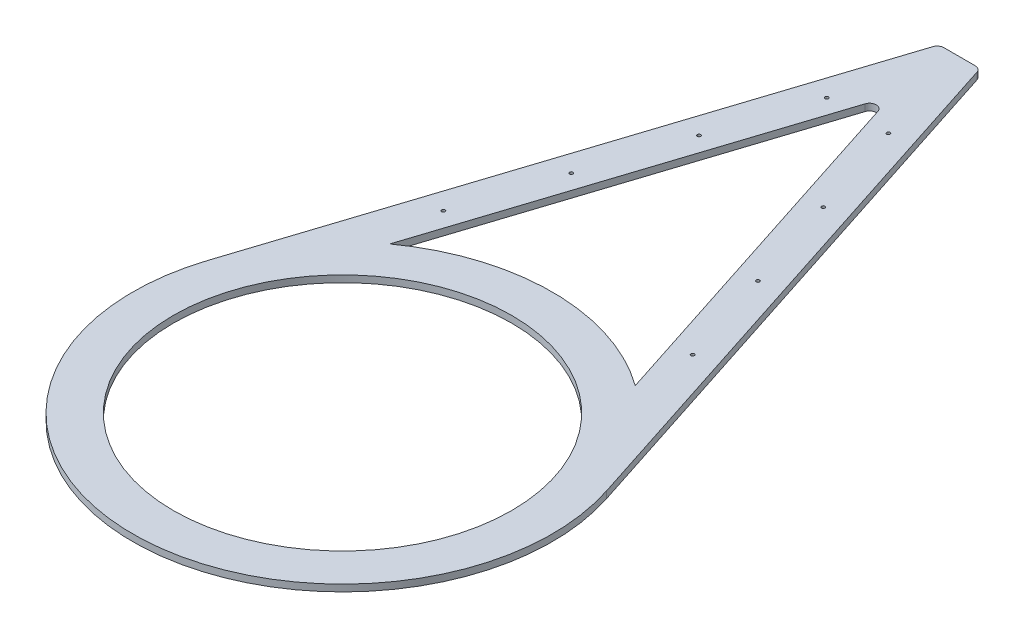
ISO-10303-21;
HEADER;
FILE_DESCRIPTION(('STEP AP214'),'2;1');
FILE_NAME('part.step','',(''),(''),'','','');
FILE_SCHEMA(('AUTOMOTIVE_DESIGN { 1 0 10303 214 1 1 1 1 }'));
ENDSEC;
DATA;
#1=APPLICATION_CONTEXT('core data for automotive mechanical design processes');
#2=APPLICATION_PROTOCOL_DEFINITION('international standard','automotive_design',2000,#1);
#3=PRODUCT_CONTEXT('',#1,'mechanical');
#4=PRODUCT('Part','Part','',(#3));
#5=PRODUCT_RELATED_PRODUCT_CATEGORY('part','',(#4));
#6=PRODUCT_DEFINITION_FORMATION('','',#4);
#7=PRODUCT_DEFINITION_CONTEXT('part definition',#1,'design');
#8=PRODUCT_DEFINITION('design','',#6,#7);
#9=PRODUCT_DEFINITION_SHAPE('','',#8);
#10=(LENGTH_UNIT() NAMED_UNIT(*) SI_UNIT(.MILLI.,.METRE.));
#11=(NAMED_UNIT(*) PLANE_ANGLE_UNIT() SI_UNIT($,.RADIAN.));
#12=(NAMED_UNIT(*) SI_UNIT($,.STERADIAN.) SOLID_ANGLE_UNIT());
#13=UNCERTAINTY_MEASURE_WITH_UNIT(LENGTH_MEASURE(1.E-05),#10,'distance_accuracy_value','');
#14=(GEOMETRIC_REPRESENTATION_CONTEXT(3) GLOBAL_UNCERTAINTY_ASSIGNED_CONTEXT((#13)) GLOBAL_UNIT_ASSIGNED_CONTEXT((#10,
#11,#12)) REPRESENTATION_CONTEXT('',''));
#15=CARTESIAN_POINT('',(0.,0.,0.));
#16=DIRECTION('',(0.,0.,1.));
#17=DIRECTION('',(1.,0.,0.));
#18=AXIS2_PLACEMENT_3D('',#15,#16,#17);
#19=CARTESIAN_POINT('',(-250.781032551846,10.,-37.0633584025956));
#20=DIRECTION('',(-0.951348450923488,0.,-0.308117063671392));
#21=DIRECTION('',(-0.308117063671392,0.,0.951348450923488));
#22=AXIS2_PLACEMENT_3D('',#19,#20,#21);
#23=PLANE('',#22);
#24=DIRECTION('',(0.308117063671392,0.,-0.951348450923488));
#25=VECTOR('',#24,1.);
#26=CARTESIAN_POINT('',(-250.781032551846,0.,-37.0633584025956));
#27=LINE('',#26,#25);
#28=CARTESIAN_POINT('',(-181.388362207426,0.,-251.321564848491));
#29=VERTEX_POINT('',#28);
#30=CARTESIAN_POINT('',(-9.51348450923489,0.,-782.005898596476));
#31=VERTEX_POINT('',#30);
#32=EDGE_CURVE('E187',#29,#31,#27,.T.);
#33=ORIENTED_EDGE('',*,*,#32,.T.);
#34=DIRECTION('',(0.,-1.,0.));
#35=VECTOR('',#34,1.);
#36=CARTESIAN_POINT('',(-9.51348450923489,10.,-782.005898596476));
#37=LINE('',#36,#35);
#38=CARTESIAN_POINT('',(-9.51348450923489,10.,-782.005898596476));
#39=VERTEX_POINT('',#38);
#40=EDGE_CURVE('E11',#39,#31,#37,.T.);
#41=ORIENTED_EDGE('',*,*,#40,.F.);
#42=DIRECTION('',(0.308117063671392,0.,-0.951348450923488));
#43=VECTOR('',#42,1.);
#44=CARTESIAN_POINT('',(-250.781032551846,10.,-37.0633584025956));
#45=LINE('',#44,#43);
#46=CARTESIAN_POINT('',(-181.388362207426,10.,-251.321564848491));
#47=VERTEX_POINT('',#46);
#48=EDGE_CURVE('E125',#47,#39,#45,.T.);
#49=ORIENTED_EDGE('',*,*,#48,.F.);
#50=DIRECTION('',(0.,-1.,0.));
#51=VECTOR('',#50,1.);
#52=CARTESIAN_POINT('',(-181.388362207426,10.,-251.321564848491));
#53=LINE('',#52,#51);
#54=EDGE_CURVE('E201',#47,#29,#53,.T.);
#55=ORIENTED_EDGE('',*,*,#54,.T.);
#56=EDGE_LOOP('',(#33,#41,#49,#55));
#57=FACE_BOUND('',#56,.T.);
#58=ADVANCED_FACE('F35',(#57),#23,.F.);
#59=CARTESIAN_POINT('',(0.,10.,-778.924727959763));
#60=DIRECTION('',(0.,-1.,0.));
#61=DIRECTION('',(0.,0.,-1.));
#62=AXIS2_PLACEMENT_3D('',#59,#60,#61);
#63=CYLINDRICAL_SURFACE('',#62,9.99999999999999);
#64=CARTESIAN_POINT('',(0.,0.,-778.924727959763));
#65=DIRECTION('',(0.,1.,0.));
#66=DIRECTION('',(0.,0.,1.));
#67=AXIS2_PLACEMENT_3D('',#64,#65,#66);
#68=CIRCLE('',#67,9.99999999999999);
#69=CARTESIAN_POINT('',(9.51348450923495,0.,-782.005898596477));
#70=VERTEX_POINT('',#69);
#71=EDGE_CURVE('E131',#31,#70,#68,.F.);
#72=ORIENTED_EDGE('',*,*,#71,.T.);
#73=DIRECTION('',(0.,-1.,0.));
#74=VECTOR('',#73,1.);
#75=CARTESIAN_POINT('',(9.51348450923495,10.,-782.005898596477));
#76=LINE('',#75,#74);
#77=CARTESIAN_POINT('',(9.51348450923495,10.,-782.005898596477));
#78=VERTEX_POINT('',#77);
#79=EDGE_CURVE('E45',#78,#70,#76,.T.);
#80=ORIENTED_EDGE('',*,*,#79,.F.);
#81=CARTESIAN_POINT('',(0.,10.,-778.924727959763));
#82=DIRECTION('',(0.,1.,0.));
#83=DIRECTION('',(0.,0.,1.));
#84=AXIS2_PLACEMENT_3D('',#81,#82,#83);
#85=CIRCLE('',#84,9.99999999999999);
#86=EDGE_CURVE('E118',#39,#78,#85,.F.);
#87=ORIENTED_EDGE('',*,*,#86,.F.);
#88=ORIENTED_EDGE('',*,*,#40,.T.);
#89=EDGE_LOOP('',(#72,#80,#87,#88));
#90=FACE_BOUND('',#89,.T.);
#91=ADVANCED_FACE('F130',(#90),#63,.F.);
#92=CARTESIAN_POINT('',(48.3839562648249,10.,-661.988647196262));
#93=DIRECTION('',(-0.951348450923487,0.,0.308117063671394));
#94=DIRECTION('',(0.308117063671394,0.,0.951348450923487));
#95=AXIS2_PLACEMENT_3D('',#92,#93,#94);
#96=PLANE('',#95);
#97=DIRECTION('',(-0.308117063671394,0.,-0.951348450923487));
#98=VECTOR('',#97,1.);
#99=CARTESIAN_POINT('',(48.3839562648249,0.,-661.988647196262));
#100=LINE('',#99,#98);
#101=CARTESIAN_POINT('',(181.388362207428,0.,-251.32156484849));
#102=VERTEX_POINT('',#101);
#103=EDGE_CURVE('E191',#102,#70,#100,.T.);
#104=ORIENTED_EDGE('',*,*,#103,.F.);
#105=DIRECTION('',(0.,-1.,0.));
#106=VECTOR('',#105,1.);
#107=CARTESIAN_POINT('',(181.388362207428,10.,-251.32156484849));
#108=LINE('',#107,#106);
#109=CARTESIAN_POINT('',(181.388362207428,10.,-251.32156484849));
#110=VERTEX_POINT('',#109);
#111=EDGE_CURVE('E88',#110,#102,#108,.T.);
#112=ORIENTED_EDGE('',*,*,#111,.F.);
#113=DIRECTION('',(-0.308117063671394,0.,-0.951348450923487));
#114=VECTOR('',#113,1.);
#115=CARTESIAN_POINT('',(48.3839562648249,10.,-661.988647196262));
#116=LINE('',#115,#114);
#117=EDGE_CURVE('E123',#110,#78,#116,.T.);
#118=ORIENTED_EDGE('',*,*,#117,.T.);
#119=ORIENTED_EDGE('',*,*,#79,.T.);
#120=EDGE_LOOP('',(#104,#112,#118,#119));
#121=FACE_BOUND('',#120,.T.);
#122=ADVANCED_FACE('F136',(#121),#96,.T.);
#123=CARTESIAN_POINT('',(23.1136744500693,10.,-902.102593467323));
#124=DIRECTION('',(0.,-1.,0.));
#125=DIRECTION('',(0.,0.,-1.));
#126=AXIS2_PLACEMENT_3D('',#123,#124,#125);
#127=CYLINDRICAL_SURFACE('',#126,10.);
#128=CARTESIAN_POINT('',(23.1136744500693,0.,-902.102593467323));
#129=DIRECTION('',(0.,1.,0.));
#130=DIRECTION('',(0.,0.,1.));
#131=AXIS2_PLACEMENT_3D('',#128,#129,#130);
#132=CIRCLE('',#131,10.);
#133=CARTESIAN_POINT('',(23.1136744500693,0.,-912.102593467323));
#134=VERTEX_POINT('',#133);
#135=CARTESIAN_POINT('',(32.6271589593041,0.,-905.183764104037));
#136=VERTEX_POINT('',#135);
#137=EDGE_CURVE('E166',#134,#136,#132,.F.);
#138=ORIENTED_EDGE('',*,*,#137,.F.);
#139=DIRECTION('',(0.,-1.,0.));
#140=VECTOR('',#139,1.);
#141=CARTESIAN_POINT('',(23.1136744500693,10.,-912.102593467323));
#142=LINE('',#141,#140);
#143=CARTESIAN_POINT('',(23.1136744500693,10.,-912.102593467323));
#144=VERTEX_POINT('',#143);
#145=EDGE_CURVE('E39',#144,#134,#142,.T.);
#146=ORIENTED_EDGE('',*,*,#145,.F.);
#147=CARTESIAN_POINT('',(23.1136744500693,10.,-902.102593467323));
#148=DIRECTION('',(0.,1.,0.));
#149=DIRECTION('',(0.,0.,1.));
#150=AXIS2_PLACEMENT_3D('',#147,#148,#149);
#151=CIRCLE('',#150,10.);
#152=CARTESIAN_POINT('',(32.6271589593041,10.,-905.183764104037));
#153=VERTEX_POINT('',#152);
#154=EDGE_CURVE('E352',#144,#153,#151,.F.);
#155=ORIENTED_EDGE('',*,*,#154,.T.);
#156=DIRECTION('',(0.,-1.,0.));
#157=VECTOR('',#156,1.);
#158=CARTESIAN_POINT('',(32.6271589593041,10.,-905.183764104037));
#159=LINE('',#158,#157);
#160=EDGE_CURVE('E147',#153,#136,#159,.T.);
#161=ORIENTED_EDGE('',*,*,#160,.T.);
#162=EDGE_LOOP('',(#138,#146,#155,#161));
#163=FACE_BOUND('',#162,.T.);
#164=ADVANCED_FACE('F221',(#163),#127,.T.);
#165=CARTESIAN_POINT('',(-1065.96449162998,10.,-912.102593467323));
#166=DIRECTION('',(0.,0.,-1.));
#167=DIRECTION('',(-1.,0.,0.));
#168=AXIS2_PLACEMENT_3D('',#165,#166,#167);
#169=PLANE('',#168);
#170=DIRECTION('',(1.,0.,0.));
#171=VECTOR('',#170,1.);
#172=CARTESIAN_POINT('',(-1065.96449162998,0.,-912.102593467323));
#173=LINE('',#172,#171);
#174=CARTESIAN_POINT('',(-23.1136744500693,0.,-912.102593467323));
#175=VERTEX_POINT('',#174);
#176=EDGE_CURVE('E169',#175,#134,#173,.T.);
#177=ORIENTED_EDGE('',*,*,#176,.F.);
#178=DIRECTION('',(0.,-1.,0.));
#179=VECTOR('',#178,1.);
#180=CARTESIAN_POINT('',(-23.1136744500693,10.,-912.102593467323));
#181=LINE('',#180,#179);
#182=CARTESIAN_POINT('',(-23.1136744500693,10.,-912.102593467323));
#183=VERTEX_POINT('',#182);
#184=EDGE_CURVE('E211',#183,#175,#181,.T.);
#185=ORIENTED_EDGE('',*,*,#184,.F.);
#186=DIRECTION('',(1.,0.,0.));
#187=VECTOR('',#186,1.);
#188=CARTESIAN_POINT('',(-1065.96449162998,10.,-912.102593467323));
#189=LINE('',#188,#187);
#190=EDGE_CURVE('E220',#183,#144,#189,.T.);
#191=ORIENTED_EDGE('',*,*,#190,.T.);
#192=ORIENTED_EDGE('',*,*,#145,.T.);
#193=EDGE_LOOP('',(#177,#185,#191,#192));
#194=FACE_BOUND('',#193,.T.);
#195=ADVANCED_FACE('F218',(#194),#169,.T.);
#196=CARTESIAN_POINT('',(-23.1136744500693,10.,-902.102593467323));
#197=DIRECTION('',(0.,-1.,0.));
#198=DIRECTION('',(0.,0.,-1.));
#199=AXIS2_PLACEMENT_3D('',#196,#197,#198);
#200=CYLINDRICAL_SURFACE('',#199,10.);
#201=CARTESIAN_POINT('',(-23.1136744500693,0.,-902.102593467323));
#202=DIRECTION('',(0.,1.,0.));
#203=DIRECTION('',(0.,0.,1.));
#204=AXIS2_PLACEMENT_3D('',#201,#202,#203);
#205=CIRCLE('',#204,10.);
#206=CARTESIAN_POINT('',(-32.627158959304,0.,-905.183764104037));
#207=VERTEX_POINT('',#206);
#208=EDGE_CURVE('E172',#175,#207,#205,.T.);
#209=ORIENTED_EDGE('',*,*,#208,.T.);
#210=DIRECTION('',(0.,-1.,0.));
#211=VECTOR('',#210,1.);
#212=CARTESIAN_POINT('',(-32.627158959304,10.,-905.183764104037));
#213=LINE('',#212,#211);
#214=CARTESIAN_POINT('',(-32.627158959304,10.,-905.183764104037));
#215=VERTEX_POINT('',#214);
#216=EDGE_CURVE('E210',#215,#207,#213,.T.);
#217=ORIENTED_EDGE('',*,*,#216,.F.);
#218=CARTESIAN_POINT('',(-23.1136744500693,10.,-902.102593467323));
#219=DIRECTION('',(0.,1.,0.));
#220=DIRECTION('',(0.,0.,1.));
#221=AXIS2_PLACEMENT_3D('',#218,#219,#220);
#222=CIRCLE('',#221,10.);
#223=EDGE_CURVE('E231',#183,#215,#222,.T.);
#224=ORIENTED_EDGE('',*,*,#223,.F.);
#225=ORIENTED_EDGE('',*,*,#184,.T.);
#226=EDGE_LOOP('',(#209,#217,#224,#225));
#227=FACE_BOUND('',#226,.T.);
#228=ADVANCED_FACE('F229',(#227),#200,.T.);
#229=CARTESIAN_POINT('',(-307.807104465457,10.,-55.5326225441193));
#230=DIRECTION('',(-0.951348450923488,0.,-0.308117063671392));
#231=DIRECTION('',(-0.308117063671392,0.,0.951348450923488));
#232=AXIS2_PLACEMENT_3D('',#229,#230,#231);
#233=PLANE('',#232);
#234=DIRECTION('',(0.308117063671392,0.,-0.951348450923488));
#235=VECTOR('',#234,1.);
#236=CARTESIAN_POINT('',(-307.807104465457,0.,-55.5326225441193));
#237=LINE('',#236,#235);
#238=CARTESIAN_POINT('',(-294.863184644482,0.,-95.4985300593717));
#239=VERTEX_POINT('',#238);
#240=EDGE_CURVE('E175',#239,#207,#237,.T.);
#241=ORIENTED_EDGE('',*,*,#240,.F.);
#242=DIRECTION('',(0.,-1.,0.));
#243=VECTOR('',#242,1.);
#244=CARTESIAN_POINT('',(-294.863184644482,10.,-95.4985300593717));
#245=LINE('',#244,#243);
#246=CARTESIAN_POINT('',(-294.863184644482,10.,-95.4985300593717));
#247=VERTEX_POINT('',#246);
#248=EDGE_CURVE('E208',#247,#239,#245,.T.);
#249=ORIENTED_EDGE('',*,*,#248,.F.);
#250=DIRECTION('',(0.308117063671392,0.,-0.951348450923488));
#251=VECTOR('',#250,1.);
#252=CARTESIAN_POINT('',(-307.807104465457,10.,-55.5326225441193));
#253=LINE('',#252,#251);
#254=EDGE_CURVE('E234',#247,#215,#253,.T.);
#255=ORIENTED_EDGE('',*,*,#254,.T.);
#256=ORIENTED_EDGE('',*,*,#216,.T.);
#257=EDGE_LOOP('',(#241,#249,#255,#256));
#258=FACE_BOUND('',#257,.T.);
#259=ADVANCED_FACE('F235',(#258),#233,.T.);
#260=CARTESIAN_POINT('',(0.,10.,0.));
#261=DIRECTION('',(0.,-1.,0.));
#262=DIRECTION('',(0.,0.,-1.));
#263=AXIS2_PLACEMENT_3D('',#260,#261,#262);
#264=CYLINDRICAL_SURFACE('',#263,309.942360612722);
#265=CARTESIAN_POINT('',(0.,0.,0.));
#266=DIRECTION('',(0.,1.,0.));
#267=DIRECTION('',(0.,0.,1.));
#268=AXIS2_PLACEMENT_3D('',#265,#266,#267);
#269=CIRCLE('',#268,309.942360612722);
#270=CARTESIAN_POINT('',(294.863184644482,0.,-95.4985300593717));
#271=VERTEX_POINT('',#270);
#272=EDGE_CURVE('E178',#239,#271,#269,.T.);
#273=ORIENTED_EDGE('',*,*,#272,.T.);
#274=DIRECTION('',(0.,-1.,0.));
#275=VECTOR('',#274,1.);
#276=CARTESIAN_POINT('',(294.863184644482,10.,-95.4985300593717));
#277=LINE('',#276,#275);
#278=CARTESIAN_POINT('',(294.863184644482,10.,-95.4985300593717));
#279=VERTEX_POINT('',#278);
#280=EDGE_CURVE('E205',#279,#271,#277,.T.);
#281=ORIENTED_EDGE('',*,*,#280,.F.);
#282=CARTESIAN_POINT('',(0.,10.,0.));
#283=DIRECTION('',(0.,1.,0.));
#284=DIRECTION('',(0.,0.,1.));
#285=AXIS2_PLACEMENT_3D('',#282,#283,#284);
#286=CIRCLE('',#285,309.942360612722);
#287=EDGE_CURVE('E239',#247,#279,#286,.T.);
#288=ORIENTED_EDGE('',*,*,#287,.F.);
#289=ORIENTED_EDGE('',*,*,#248,.T.);
#290=EDGE_LOOP('',(#273,#281,#288,#289));
#291=FACE_BOUND('',#290,.T.);
#292=ADVANCED_FACE('F285',(#291),#264,.T.);
#293=CARTESIAN_POINT('',(91.7751956112814,10.,-618.735651248539));
#294=DIRECTION('',(0.,-1.,0.));
#295=DIRECTION('',(0.,0.,-1.));
#296=AXIS2_PLACEMENT_3D('',#293,#294,#295);
#297=CYLINDRICAL_SURFACE('',#296,2.5);
#298=CARTESIAN_POINT('',(91.7751956112814,10.,-618.735651248539));
#299=DIRECTION('',(0.,1.,0.));
#300=DIRECTION('',(0.,0.,1.));
#301=AXIS2_PLACEMENT_3D('',#298,#299,#300);
#302=CIRCLE('',#301,2.5);
#303=CARTESIAN_POINT('',(91.7751956112814,10.,-616.235651248539));
#304=VERTEX_POINT('',#303);
#305=EDGE_CURVE('E138',#304,#304,#302,.F.);
#306=ORIENTED_EDGE('',*,*,#305,.F.);
#307=EDGE_LOOP('',(#306));
#308=FACE_BOUND('',#307,.T.);
#309=CARTESIAN_POINT('',(91.7751956112814,0.,-618.735651248539));
#310=DIRECTION('',(0.,1.,0.));
#311=DIRECTION('',(0.,0.,1.));
#312=AXIS2_PLACEMENT_3D('',#309,#310,#311);
#313=CIRCLE('',#312,2.5);
#314=CARTESIAN_POINT('',(91.7751956112814,0.,-616.235651248539));
#315=VERTEX_POINT('',#314);
#316=EDGE_CURVE('E194',#315,#315,#313,.F.);
#317=ORIENTED_EDGE('',*,*,#316,.T.);
#318=EDGE_LOOP('',(#317));
#319=FACE_BOUND('',#318,.T.);
#320=ADVANCED_FACE('F288',(#308,#319),#297,.F.);
#321=CARTESIAN_POINT('',(0.,10.,0.));
#322=DIRECTION('',(0.,-1.,0.));
#323=DIRECTION('',(0.,0.,-1.));
#324=AXIS2_PLACEMENT_3D('',#321,#322,#323);
#325=CYLINDRICAL_SURFACE('',#324,309.942360612722);
#326=CARTESIAN_POINT('',(0.,0.,0.));
#327=DIRECTION('',(0.,1.,0.));
#328=DIRECTION('',(0.,0.,1.));
#329=AXIS2_PLACEMENT_3D('',#326,#327,#328);
#330=CIRCLE('',#329,309.942360612722);
#331=EDGE_CURVE('E91',#102,#29,#330,.T.);
#332=ORIENTED_EDGE('',*,*,#331,.T.);
#333=ORIENTED_EDGE('',*,*,#54,.F.);
#334=CARTESIAN_POINT('',(0.,10.,0.));
#335=DIRECTION('',(0.,1.,0.));
#336=DIRECTION('',(0.,0.,1.));
#337=AXIS2_PLACEMENT_3D('',#334,#335,#336);
#338=CIRCLE('',#337,309.942360612722);
#339=EDGE_CURVE('E54',#110,#47,#338,.T.);
#340=ORIENTED_EDGE('',*,*,#339,.F.);
#341=ORIENTED_EDGE('',*,*,#111,.T.);
#342=EDGE_LOOP('',(#332,#333,#340,#341));
#343=FACE_BOUND('',#342,.T.);
#344=ADVANCED_FACE('F280',(#343),#325,.T.);
#345=CARTESIAN_POINT('',(0.,10.,0.));
#346=DIRECTION('',(0.,-1.,0.));
#347=DIRECTION('',(0.,0.,-1.));
#348=AXIS2_PLACEMENT_3D('',#345,#346,#347);
#349=CYLINDRICAL_SURFACE('',#348,250.);
#350=CARTESIAN_POINT('',(0.,10.,0.));
#351=DIRECTION('',(0.,1.,0.));
#352=DIRECTION('',(0.,0.,1.));
#353=AXIS2_PLACEMENT_3D('',#350,#351,#352);
#354=CIRCLE('',#353,250.);
#355=CARTESIAN_POINT('',(0.,10.,250.));
#356=VERTEX_POINT('',#355);
#357=EDGE_CURVE('E247',#356,#356,#354,.T.);
#358=ORIENTED_EDGE('',*,*,#357,.T.);
#359=EDGE_LOOP('',(#358));
#360=FACE_BOUND('',#359,.T.);
#361=CARTESIAN_POINT('',(0.,0.,0.));
#362=DIRECTION('',(0.,1.,0.));
#363=DIRECTION('',(0.,0.,1.));
#364=AXIS2_PLACEMENT_3D('',#361,#362,#363);
#365=CIRCLE('',#364,250.);
#366=CARTESIAN_POINT('',(0.,0.,250.));
#367=VERTEX_POINT('',#366);
#368=EDGE_CURVE('E184',#367,#367,#365,.T.);
#369=ORIENTED_EDGE('',*,*,#368,.F.);
#370=EDGE_LOOP('',(#369));
#371=FACE_BOUND('',#370,.T.);
#372=ADVANCED_FACE('F251',(#360,#371),#349,.F.);
#373=CARTESIAN_POINT('',(105.410028178436,10.,-680.457911337784));
#374=DIRECTION('',(-0.951348450923488,0.,0.308117063671392));
#375=DIRECTION('',(0.308117063671392,0.,0.951348450923488));
#376=AXIS2_PLACEMENT_3D('',#373,#374,#375);
#377=PLANE('',#376);
#378=DIRECTION('',(-0.308117063671392,0.,-0.951348450923488));
#379=VECTOR('',#378,1.);
#380=CARTESIAN_POINT('',(105.410028178436,0.,-680.457911337784));
#381=LINE('',#380,#379);
#382=EDGE_CURVE('E181',#271,#136,#381,.T.);
#383=ORIENTED_EDGE('',*,*,#382,.T.);
#384=ORIENTED_EDGE('',*,*,#160,.F.);
#385=DIRECTION('',(-0.308117063671392,0.,-0.951348450923488));
#386=VECTOR('',#385,1.);
#387=CARTESIAN_POINT('',(105.410028178436,10.,-680.457911337784));
#388=LINE('',#387,#386);
#389=EDGE_CURVE('E241',#279,#153,#388,.T.);
#390=ORIENTED_EDGE('',*,*,#389,.F.);
#391=ORIENTED_EDGE('',*,*,#280,.T.);
#392=EDGE_LOOP('',(#383,#384,#390,#391));
#393=FACE_BOUND('',#392,.T.);
#394=ADVANCED_FACE('F279',(#393),#377,.F.);
#395=CARTESIAN_POINT('',(-184.210314712699,10.,-333.331115971493));
#396=DIRECTION('',(0.,-1.,0.));
#397=DIRECTION('',(0.,0.,-1.));
#398=AXIS2_PLACEMENT_3D('',#395,#396,#397);
#399=CYLINDRICAL_SURFACE('',#398,2.5);
#400=CARTESIAN_POINT('',(-184.210314712699,10.,-333.331115971493));
#401=DIRECTION('',(0.,1.,0.));
#402=DIRECTION('',(0.,0.,1.));
#403=AXIS2_PLACEMENT_3D('',#400,#401,#402);
#404=CIRCLE('',#403,2.5);
#405=CARTESIAN_POINT('',(-184.210314712699,10.,-330.831115971493));
#406=VERTEX_POINT('',#405);
#407=EDGE_CURVE('E349',#406,#406,#404,.T.);
#408=ORIENTED_EDGE('',*,*,#407,.T.);
#409=EDGE_LOOP('',(#408));
#410=FACE_BOUND('',#409,.T.);
#411=CARTESIAN_POINT('',(-184.210314712699,0.,-333.331115971493));
#412=DIRECTION('',(0.,1.,0.));
#413=DIRECTION('',(0.,0.,1.));
#414=AXIS2_PLACEMENT_3D('',#411,#412,#413);
#415=CIRCLE('',#414,2.5);
#416=CARTESIAN_POINT('',(-184.210314712699,0.,-330.831115971493));
#417=VERTEX_POINT('',#416);
#418=EDGE_CURVE('E163',#417,#417,#415,.T.);
#419=ORIENTED_EDGE('',*,*,#418,.F.);
#420=EDGE_LOOP('',(#419));
#421=FACE_BOUND('',#420,.T.);
#422=ADVANCED_FACE('F283',(#410,#421),#399,.F.);
#423=CARTESIAN_POINT('',(-137.99275516199,10.,-476.033383610016));
#424=DIRECTION('',(0.,-1.,0.));
#425=DIRECTION('',(0.,0.,-1.));
#426=AXIS2_PLACEMENT_3D('',#423,#424,#425);
#427=CYLINDRICAL_SURFACE('',#426,2.5);
#428=CARTESIAN_POINT('',(-137.99275516199,10.,-476.033383610016));
#429=DIRECTION('',(0.,1.,0.));
#430=DIRECTION('',(0.,0.,1.));
#431=AXIS2_PLACEMENT_3D('',#428,#429,#430);
#432=CIRCLE('',#431,2.5);
#433=CARTESIAN_POINT('',(-137.99275516199,10.,-473.533383610016));
#434=VERTEX_POINT('',#433);
#435=EDGE_CURVE('E346',#434,#434,#432,.T.);
#436=ORIENTED_EDGE('',*,*,#435,.T.);
#437=EDGE_LOOP('',(#436));
#438=FACE_BOUND('',#437,.T.);
#439=CARTESIAN_POINT('',(-137.99275516199,0.,-476.033383610016));
#440=DIRECTION('',(0.,1.,0.));
#441=DIRECTION('',(0.,0.,1.));
#442=AXIS2_PLACEMENT_3D('',#439,#440,#441);
#443=CIRCLE('',#442,2.5);
#444=CARTESIAN_POINT('',(-137.99275516199,0.,-473.533383610016));
#445=VERTEX_POINT('',#444);
#446=EDGE_CURVE('E160',#445,#445,#443,.T.);
#447=ORIENTED_EDGE('',*,*,#446,.F.);
#448=EDGE_LOOP('',(#447));
#449=FACE_BOUND('',#448,.T.);
#450=ADVANCED_FACE('F300',(#438,#449),#427,.F.);
#451=CARTESIAN_POINT('',(-91.7751956112814,10.,-618.735651248539));
#452=DIRECTION('',(0.,-1.,0.));
#453=DIRECTION('',(0.,0.,-1.));
#454=AXIS2_PLACEMENT_3D('',#451,#452,#453);
#455=CYLINDRICAL_SURFACE('',#454,2.5);
#456=CARTESIAN_POINT('',(-91.7751956112814,10.,-618.735651248539));
#457=DIRECTION('',(0.,1.,0.));
#458=DIRECTION('',(0.,0.,1.));
#459=AXIS2_PLACEMENT_3D('',#456,#457,#458);
#460=CIRCLE('',#459,2.5);
#461=CARTESIAN_POINT('',(-91.7751956112814,10.,-616.235651248539));
#462=VERTEX_POINT('',#461);
#463=EDGE_CURVE('E340',#462,#462,#460,.T.);
#464=ORIENTED_EDGE('',*,*,#463,.T.);
#465=EDGE_LOOP('',(#464));
#466=FACE_BOUND('',#465,.T.);
#467=CARTESIAN_POINT('',(-91.7751956112814,0.,-618.735651248539));
#468=DIRECTION('',(0.,1.,0.));
#469=DIRECTION('',(0.,0.,1.));
#470=AXIS2_PLACEMENT_3D('',#467,#468,#469);
#471=CIRCLE('',#470,2.5);
#472=CARTESIAN_POINT('',(-91.7751956112814,0.,-616.235651248539));
#473=VERTEX_POINT('',#472);
#474=EDGE_CURVE('E157',#473,#473,#471,.T.);
#475=ORIENTED_EDGE('',*,*,#474,.F.);
#476=EDGE_LOOP('',(#475));
#477=FACE_BOUND('',#476,.T.);
#478=ADVANCED_FACE('F304',(#466,#477),#455,.F.);
#479=CARTESIAN_POINT('',(-45.5576360605726,10.,-761.437918887062));
#480=DIRECTION('',(0.,-1.,0.));
#481=DIRECTION('',(0.,0.,-1.));
#482=AXIS2_PLACEMENT_3D('',#479,#480,#481);
#483=CYLINDRICAL_SURFACE('',#482,2.5);
#484=CARTESIAN_POINT('',(-45.5576360605726,10.,-761.437918887062));
#485=DIRECTION('',(0.,1.,0.));
#486=DIRECTION('',(0.,0.,1.));
#487=AXIS2_PLACEMENT_3D('',#484,#485,#486);
#488=CIRCLE('',#487,2.5);
#489=CARTESIAN_POINT('',(-45.5576360605726,10.,-758.937918887062));
#490=VERTEX_POINT('',#489);
#491=EDGE_CURVE('E337',#490,#490,#488,.T.);
#492=ORIENTED_EDGE('',*,*,#491,.T.);
#493=EDGE_LOOP('',(#492));
#494=FACE_BOUND('',#493,.T.);
#495=CARTESIAN_POINT('',(-45.5576360605726,0.,-761.437918887062));
#496=DIRECTION('',(0.,1.,0.));
#497=DIRECTION('',(0.,0.,1.));
#498=AXIS2_PLACEMENT_3D('',#495,#496,#497);
#499=CIRCLE('',#498,2.5);
#500=CARTESIAN_POINT('',(-45.5576360605726,0.,-758.937918887062));
#501=VERTEX_POINT('',#500);
#502=EDGE_CURVE('E154',#501,#501,#499,.T.);
#503=ORIENTED_EDGE('',*,*,#502,.F.);
#504=EDGE_LOOP('',(#503));
#505=FACE_BOUND('',#504,.T.);
#506=ADVANCED_FACE('F308',(#494,#505),#483,.F.);
#507=CARTESIAN_POINT('',(45.5576360605726,10.,-761.437918887062));
#508=DIRECTION('',(0.,-1.,0.));
#509=DIRECTION('',(0.,0.,-1.));
#510=AXIS2_PLACEMENT_3D('',#507,#508,#509);
#511=CYLINDRICAL_SURFACE('',#510,2.5);
#512=CARTESIAN_POINT('',(45.5576360605726,10.,-761.437918887062));
#513=DIRECTION('',(0.,1.,0.));
#514=DIRECTION('',(0.,0.,1.));
#515=AXIS2_PLACEMENT_3D('',#512,#513,#514);
#516=CIRCLE('',#515,2.5);
#517=CARTESIAN_POINT('',(45.5576360605726,10.,-758.937918887062));
#518=VERTEX_POINT('',#517);
#519=EDGE_CURVE('E322',#518,#518,#516,.F.);
#520=ORIENTED_EDGE('',*,*,#519,.F.);
#521=EDGE_LOOP('',(#520));
#522=FACE_BOUND('',#521,.T.);
#523=CARTESIAN_POINT('',(45.5576360605726,0.,-761.437918887062));
#524=DIRECTION('',(0.,1.,0.));
#525=DIRECTION('',(0.,0.,1.));
#526=AXIS2_PLACEMENT_3D('',#523,#524,#525);
#527=CIRCLE('',#526,2.5);
#528=CARTESIAN_POINT('',(45.5576360605726,0.,-758.937918887062));
#529=VERTEX_POINT('',#528);
#530=EDGE_CURVE('E151',#529,#529,#527,.F.);
#531=ORIENTED_EDGE('',*,*,#530,.T.);
#532=EDGE_LOOP('',(#531));
#533=FACE_BOUND('',#532,.T.);
#534=ADVANCED_FACE('F311',(#522,#533),#511,.F.);
#535=CARTESIAN_POINT('',(137.99275516199,10.,-476.033383610016));
#536=DIRECTION('',(0.,-1.,0.));
#537=DIRECTION('',(0.,0.,-1.));
#538=AXIS2_PLACEMENT_3D('',#535,#536,#537);
#539=CYLINDRICAL_SURFACE('',#538,2.5);
#540=CARTESIAN_POINT('',(137.99275516199,10.,-476.033383610016));
#541=DIRECTION('',(0.,1.,0.));
#542=DIRECTION('',(0.,0.,1.));
#543=AXIS2_PLACEMENT_3D('',#540,#541,#542);
#544=CIRCLE('',#543,2.5);
#545=CARTESIAN_POINT('',(137.99275516199,10.,-473.533383610016));
#546=VERTEX_POINT('',#545);
#547=EDGE_CURVE('E200',#546,#546,#544,.F.);
#548=ORIENTED_EDGE('',*,*,#547,.F.);
#549=EDGE_LOOP('',(#548));
#550=FACE_BOUND('',#549,.T.);
#551=CARTESIAN_POINT('',(137.99275516199,0.,-476.033383610016));
#552=DIRECTION('',(0.,1.,0.));
#553=DIRECTION('',(0.,0.,1.));
#554=AXIS2_PLACEMENT_3D('',#551,#552,#553);
#555=CIRCLE('',#554,2.5);
#556=CARTESIAN_POINT('',(137.99275516199,0.,-473.533383610016));
#557=VERTEX_POINT('',#556);
#558=EDGE_CURVE('E148',#557,#557,#555,.F.);
#559=ORIENTED_EDGE('',*,*,#558,.T.);
#560=EDGE_LOOP('',(#559));
#561=FACE_BOUND('',#560,.T.);
#562=ADVANCED_FACE('F37',(#550,#561),#539,.F.);
#563=CARTESIAN_POINT('',(184.210314712699,10.,-333.331115971493));
#564=DIRECTION('',(0.,-1.,0.));
#565=DIRECTION('',(0.,0.,-1.));
#566=AXIS2_PLACEMENT_3D('',#563,#564,#565);
#567=CYLINDRICAL_SURFACE('',#566,2.5);
#568=CARTESIAN_POINT('',(184.210314712699,10.,-333.331115971493));
#569=DIRECTION('',(0.,1.,0.));
#570=DIRECTION('',(0.,0.,1.));
#571=AXIS2_PLACEMENT_3D('',#568,#569,#570);
#572=CIRCLE('',#571,2.5);
#573=CARTESIAN_POINT('',(184.210314712699,10.,-330.831115971493));
#574=VERTEX_POINT('',#573);
#575=EDGE_CURVE('E144',#574,#574,#572,.F.);
#576=ORIENTED_EDGE('',*,*,#575,.F.);
#577=EDGE_LOOP('',(#576));
#578=FACE_BOUND('',#577,.T.);
#579=CARTESIAN_POINT('',(184.210314712699,0.,-333.331115971493));
#580=DIRECTION('',(0.,1.,0.));
#581=DIRECTION('',(0.,0.,1.));
#582=AXIS2_PLACEMENT_3D('',#579,#580,#581);
#583=CIRCLE('',#582,2.5);
#584=CARTESIAN_POINT('',(184.210314712699,0.,-330.831115971493));
#585=VERTEX_POINT('',#584);
#586=EDGE_CURVE('E197',#585,#585,#583,.F.);
#587=ORIENTED_EDGE('',*,*,#586,.T.);
#588=EDGE_LOOP('',(#587));
#589=FACE_BOUND('',#588,.T.);
#590=ADVANCED_FACE('F255',(#578,#589),#567,.F.);
#591=CARTESIAN_POINT('',(-1065.96449162998,10.,-301.0801164273));
#592=DIRECTION('',(0.,1.,0.));
#593=DIRECTION('',(0.,0.,1.));
#594=AXIS2_PLACEMENT_3D('',#591,#592,#593);
#595=PLANE('',#594);
#596=ORIENTED_EDGE('',*,*,#547,.T.);
#597=EDGE_LOOP('',(#596));
#598=FACE_BOUND('',#597,.T.);
#599=ORIENTED_EDGE('',*,*,#519,.T.);
#600=EDGE_LOOP('',(#599));
#601=FACE_BOUND('',#600,.T.);
#602=ORIENTED_EDGE('',*,*,#491,.F.);
#603=EDGE_LOOP('',(#602));
#604=FACE_BOUND('',#603,.T.);
#605=ORIENTED_EDGE('',*,*,#463,.F.);
#606=EDGE_LOOP('',(#605));
#607=FACE_BOUND('',#606,.T.);
#608=ORIENTED_EDGE('',*,*,#435,.F.);
#609=EDGE_LOOP('',(#608));
#610=FACE_BOUND('',#609,.T.);
#611=ORIENTED_EDGE('',*,*,#407,.F.);
#612=EDGE_LOOP('',(#611));
#613=FACE_BOUND('',#612,.T.);
#614=ORIENTED_EDGE('',*,*,#154,.F.);
#615=ORIENTED_EDGE('',*,*,#190,.F.);
#616=ORIENTED_EDGE('',*,*,#223,.T.);
#617=ORIENTED_EDGE('',*,*,#254,.F.);
#618=ORIENTED_EDGE('',*,*,#287,.T.);
#619=ORIENTED_EDGE('',*,*,#389,.T.);
#620=EDGE_LOOP('',(#614,#615,#616,#617,#618,#619));
#621=FACE_BOUND('',#620,.T.);
#622=ORIENTED_EDGE('',*,*,#357,.F.);
#623=EDGE_LOOP('',(#622));
#624=FACE_BOUND('',#623,.T.);
#625=ORIENTED_EDGE('',*,*,#48,.T.);
#626=ORIENTED_EDGE('',*,*,#86,.T.);
#627=ORIENTED_EDGE('',*,*,#117,.F.);
#628=ORIENTED_EDGE('',*,*,#339,.T.);
#629=EDGE_LOOP('',(#625,#626,#627,#628));
#630=FACE_BOUND('',#629,.T.);
#631=ORIENTED_EDGE('',*,*,#305,.T.);
#632=EDGE_LOOP('',(#631));
#633=FACE_BOUND('',#632,.T.);
#634=ORIENTED_EDGE('',*,*,#575,.T.);
#635=EDGE_LOOP('',(#634));
#636=FACE_BOUND('',#635,.T.);
#637=ADVANCED_FACE('F120',(#598,#601,#604,#607,#610,#613,#621,#624,#630,#633,#636),#595,.T.);
#638=CARTESIAN_POINT('',(-1065.96449162998,0.,-301.0801164273));
#639=DIRECTION('',(0.,1.,0.));
#640=DIRECTION('',(0.,0.,1.));
#641=AXIS2_PLACEMENT_3D('',#638,#639,#640);
#642=PLANE('',#641);
#643=ORIENTED_EDGE('',*,*,#558,.F.);
#644=EDGE_LOOP('',(#643));
#645=FACE_BOUND('',#644,.T.);
#646=ORIENTED_EDGE('',*,*,#530,.F.);
#647=EDGE_LOOP('',(#646));
#648=FACE_BOUND('',#647,.T.);
#649=ORIENTED_EDGE('',*,*,#502,.T.);
#650=EDGE_LOOP('',(#649));
#651=FACE_BOUND('',#650,.T.);
#652=ORIENTED_EDGE('',*,*,#474,.T.);
#653=EDGE_LOOP('',(#652));
#654=FACE_BOUND('',#653,.T.);
#655=ORIENTED_EDGE('',*,*,#446,.T.);
#656=EDGE_LOOP('',(#655));
#657=FACE_BOUND('',#656,.T.);
#658=ORIENTED_EDGE('',*,*,#418,.T.);
#659=EDGE_LOOP('',(#658));
#660=FACE_BOUND('',#659,.T.);
#661=ORIENTED_EDGE('',*,*,#137,.T.);
#662=ORIENTED_EDGE('',*,*,#382,.F.);
#663=ORIENTED_EDGE('',*,*,#272,.F.);
#664=ORIENTED_EDGE('',*,*,#240,.T.);
#665=ORIENTED_EDGE('',*,*,#208,.F.);
#666=ORIENTED_EDGE('',*,*,#176,.T.);
#667=EDGE_LOOP('',(#661,#662,#663,#664,#665,#666));
#668=FACE_BOUND('',#667,.T.);
#669=ORIENTED_EDGE('',*,*,#368,.T.);
#670=EDGE_LOOP('',(#669));
#671=FACE_BOUND('',#670,.T.);
#672=ORIENTED_EDGE('',*,*,#32,.F.);
#673=ORIENTED_EDGE('',*,*,#331,.F.);
#674=ORIENTED_EDGE('',*,*,#103,.T.);
#675=ORIENTED_EDGE('',*,*,#71,.F.);
#676=EDGE_LOOP('',(#672,#673,#674,#675));
#677=FACE_BOUND('',#676,.T.);
#678=ORIENTED_EDGE('',*,*,#316,.F.);
#679=EDGE_LOOP('',(#678));
#680=FACE_BOUND('',#679,.T.);
#681=ORIENTED_EDGE('',*,*,#586,.F.);
#682=EDGE_LOOP('',(#681));
#683=FACE_BOUND('',#682,.T.);
#684=ADVANCED_FACE('F224',(#645,#648,#651,#654,#657,#660,#668,#671,#677,#680,#683),#642,.F.);
#685=CLOSED_SHELL('',(#58,#91,#122,#164,#195,#228,#259,#292,#320,#344,#372,#394,#422,#450,#478,
#506,#534,#562,#590,#637,#684));
#686=MANIFOLD_SOLID_BREP('B2',#685);
#687=ADVANCED_BREP_SHAPE_REPRESENTATION('',(#18,#686),#14);
#688=SHAPE_DEFINITION_REPRESENTATION(#9,#687);
ENDSEC;
END-ISO-10303-21;
